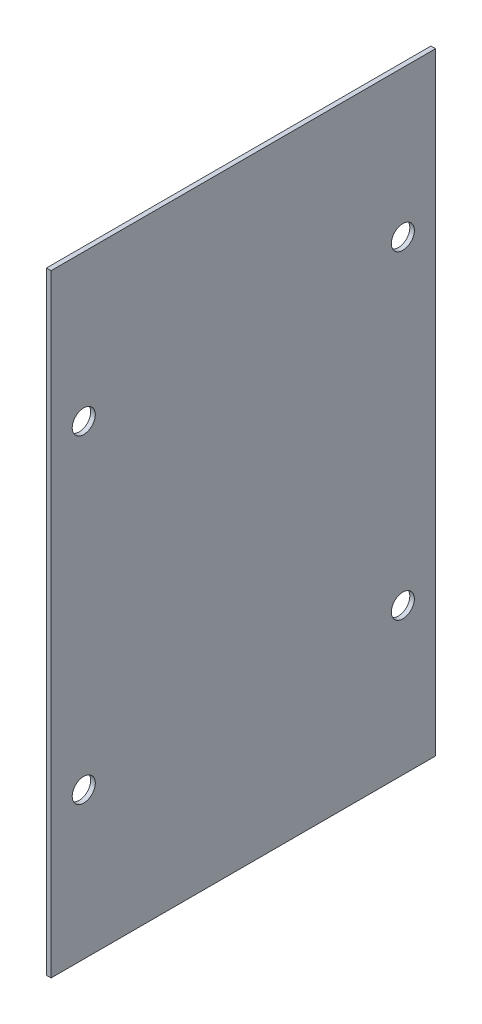
ISO-10303-21;
HEADER;
FILE_DESCRIPTION(('STEP AP214'),'2;1');
FILE_NAME('part.step','',(''),(''),'','','');
FILE_SCHEMA(('AUTOMOTIVE_DESIGN { 1 0 10303 214 1 1 1 1 }'));
ENDSEC;
DATA;
#1=APPLICATION_CONTEXT('core data for automotive mechanical design processes');
#2=APPLICATION_PROTOCOL_DEFINITION('international standard','automotive_design',2000,#1);
#3=PRODUCT_CONTEXT('',#1,'mechanical');
#4=PRODUCT('Part','Part','',(#3));
#5=PRODUCT_RELATED_PRODUCT_CATEGORY('part','',(#4));
#6=PRODUCT_DEFINITION_FORMATION('','',#4);
#7=PRODUCT_DEFINITION_CONTEXT('part definition',#1,'design');
#8=PRODUCT_DEFINITION('design','',#6,#7);
#9=PRODUCT_DEFINITION_SHAPE('','',#8);
#10=(LENGTH_UNIT() NAMED_UNIT(*) SI_UNIT(.MILLI.,.METRE.));
#11=(NAMED_UNIT(*) PLANE_ANGLE_UNIT() SI_UNIT($,.RADIAN.));
#12=(NAMED_UNIT(*) SI_UNIT($,.STERADIAN.) SOLID_ANGLE_UNIT());
#13=UNCERTAINTY_MEASURE_WITH_UNIT(LENGTH_MEASURE(1.E-05),#10,'distance_accuracy_value','');
#14=(GEOMETRIC_REPRESENTATION_CONTEXT(3) GLOBAL_UNCERTAINTY_ASSIGNED_CONTEXT((#13)) GLOBAL_UNIT_ASSIGNED_CONTEXT((#10,
#11,#12)) REPRESENTATION_CONTEXT('',''));
#15=CARTESIAN_POINT('',(0.,0.,0.));
#16=DIRECTION('',(0.,0.,1.));
#17=DIRECTION('',(1.,0.,0.));
#18=AXIS2_PLACEMENT_3D('',#15,#16,#17);
#19=CARTESIAN_POINT('',(-50.,47.,-49.9999999999997));
#20=DIRECTION('',(0.,0.,-1.));
#21=DIRECTION('',(0.,-1.,0.));
#22=AXIS2_PLACEMENT_3D('',#19,#20,#21);
#23=PLANE('',#22);
#24=DIRECTION('',(1.,0.,0.));
#25=VECTOR('',#24,1.);
#26=CARTESIAN_POINT('',(-50.,47.,-49.9999999999997));
#27=LINE('',#26,#25);
#28=CARTESIAN_POINT('',(-51.2,47.,-50.));
#29=VERTEX_POINT('',#28);
#30=CARTESIAN_POINT('',(-50.,47.,-49.9999999999997));
#31=VERTEX_POINT('',#30);
#32=EDGE_CURVE('E11',#29,#31,#27,.T.);
#33=ORIENTED_EDGE('',*,*,#32,.F.);
#34=DIRECTION('',(0.,1.,0.));
#35=VECTOR('',#34,1.);
#36=CARTESIAN_POINT('',(-51.1999999999999,0.,-50.0000000000001));
#37=LINE('',#36,#35);
#38=CARTESIAN_POINT('',(-51.1999999999998,206.324640740579,-50.));
#39=VERTEX_POINT('',#38);
#40=EDGE_CURVE('E98',#39,#29,#37,.F.);
#41=ORIENTED_EDGE('',*,*,#40,.F.);
#42=DIRECTION('',(1.,0.,0.));
#43=VECTOR('',#42,1.);
#44=CARTESIAN_POINT('',(-49.9999999999998,206.324640740579,-49.9999999999997));
#45=LINE('',#44,#43);
#46=CARTESIAN_POINT('',(-49.9999999999998,206.324640740579,-49.9999999999997));
#47=VERTEX_POINT('',#46);
#48=EDGE_CURVE('E53',#39,#47,#45,.T.);
#49=ORIENTED_EDGE('',*,*,#48,.T.);
#50=DIRECTION('',(0.,-1.,0.));
#51=VECTOR('',#50,1.);
#52=CARTESIAN_POINT('',(-50.,47.,-49.9999999999997));
#53=LINE('',#52,#51);
#54=EDGE_CURVE('E124',#47,#31,#53,.T.);
#55=ORIENTED_EDGE('',*,*,#54,.T.);
#56=EDGE_LOOP('',(#33,#41,#49,#55));
#57=FACE_BOUND('',#56,.T.);
#58=ADVANCED_FACE('F42',(#57),#23,.T.);
#59=CARTESIAN_POINT('',(-49.9999999999998,206.324640740579,-49.9999999999997));
#60=DIRECTION('',(0.,1.,0.));
#61=DIRECTION('',(0.,0.,-1.));
#62=AXIS2_PLACEMENT_3D('',#59,#60,#61);
#63=PLANE('',#62);
#64=ORIENTED_EDGE('',*,*,#48,.F.);
#65=DIRECTION('',(0.,0.,1.));
#66=VECTOR('',#65,1.);
#67=CARTESIAN_POINT('',(-51.1999999999999,206.324640740579,0.));
#68=LINE('',#67,#66);
#69=CARTESIAN_POINT('',(-51.2,206.324640740579,50.));
#70=VERTEX_POINT('',#69);
#71=EDGE_CURVE('E112',#70,#39,#68,.F.);
#72=ORIENTED_EDGE('',*,*,#71,.F.);
#73=DIRECTION('',(1.,0.,0.));
#74=VECTOR('',#73,1.);
#75=CARTESIAN_POINT('',(-50.,206.324640740579,50.));
#76=LINE('',#75,#74);
#77=CARTESIAN_POINT('',(-50.,206.324640740579,50.));
#78=VERTEX_POINT('',#77);
#79=EDGE_CURVE('E61',#70,#78,#76,.T.);
#80=ORIENTED_EDGE('',*,*,#79,.T.);
#81=DIRECTION('',(0.,0.,-1.));
#82=VECTOR('',#81,1.);
#83=CARTESIAN_POINT('',(-49.9999999999998,206.324640740579,-49.9999999999997));
#84=LINE('',#83,#82);
#85=EDGE_CURVE('E92',#78,#47,#84,.T.);
#86=ORIENTED_EDGE('',*,*,#85,.T.);
#87=EDGE_LOOP('',(#64,#72,#80,#86));
#88=FACE_BOUND('',#87,.T.);
#89=ADVANCED_FACE('F129',(#88),#63,.T.);
#90=CARTESIAN_POINT('',(-50.,206.324640740579,50.));
#91=DIRECTION('',(0.,0.,1.));
#92=DIRECTION('',(0.,1.,0.));
#93=AXIS2_PLACEMENT_3D('',#90,#91,#92);
#94=PLANE('',#93);
#95=ORIENTED_EDGE('',*,*,#79,.F.);
#96=DIRECTION('',(0.,1.,0.));
#97=VECTOR('',#96,1.);
#98=CARTESIAN_POINT('',(-51.2000000000001,0.,50.));
#99=LINE('',#98,#97);
#100=CARTESIAN_POINT('',(-51.2,46.9999999999999,50.));
#101=VERTEX_POINT('',#100);
#102=EDGE_CURVE('E97',#101,#70,#99,.T.);
#103=ORIENTED_EDGE('',*,*,#102,.F.);
#104=DIRECTION('',(1.,0.,0.));
#105=VECTOR('',#104,1.);
#106=CARTESIAN_POINT('',(-50.0000000000001,46.9999999999999,50.));
#107=LINE('',#106,#105);
#108=CARTESIAN_POINT('',(-50.0000000000001,46.9999999999999,50.));
#109=VERTEX_POINT('',#108);
#110=EDGE_CURVE('E46',#101,#109,#107,.T.);
#111=ORIENTED_EDGE('',*,*,#110,.T.);
#112=DIRECTION('',(0.,1.,0.));
#113=VECTOR('',#112,1.);
#114=CARTESIAN_POINT('',(-50.,206.324640740579,50.));
#115=LINE('',#114,#113);
#116=EDGE_CURVE('E205',#109,#78,#115,.T.);
#117=ORIENTED_EDGE('',*,*,#116,.T.);
#118=EDGE_LOOP('',(#95,#103,#111,#117));
#119=FACE_BOUND('',#118,.T.);
#120=ADVANCED_FACE('F101',(#119),#94,.T.);
#121=CARTESIAN_POINT('',(-49.9999999999999,168.16232037029,-41.4999999999997));
#122=DIRECTION('',(-1.,0.,0.));
#123=DIRECTION('',(0.,0.,1.));
#124=AXIS2_PLACEMENT_3D('',#121,#122,#123);
#125=CYLINDRICAL_SURFACE('',#124,3.);
#126=CARTESIAN_POINT('',(-49.9999999999999,168.16232037029,-41.4999999999997));
#127=DIRECTION('',(-1.,0.,0.));
#128=DIRECTION('',(0.,0.,1.));
#129=AXIS2_PLACEMENT_3D('',#126,#127,#128);
#130=CIRCLE('',#129,3.);
#131=CARTESIAN_POINT('',(-49.9999999999999,168.16232037029,-38.4999999999997));
#132=VERTEX_POINT('',#131);
#133=EDGE_CURVE('E115',#132,#132,#130,.T.);
#134=ORIENTED_EDGE('',*,*,#133,.F.);
#135=EDGE_LOOP('',(#134));
#136=FACE_BOUND('',#135,.T.);
#137=CARTESIAN_POINT('',(-51.1999999999999,168.16232037029,-41.5));
#138=DIRECTION('',(-1.,0.,0.));
#139=DIRECTION('',(0.,0.,1.));
#140=AXIS2_PLACEMENT_3D('',#137,#138,#139);
#141=CIRCLE('',#140,3.);
#142=CARTESIAN_POINT('',(-51.1999999999999,168.16232037029,-38.5));
#143=VERTEX_POINT('',#142);
#144=EDGE_CURVE('E136',#143,#143,#141,.T.);
#145=ORIENTED_EDGE('',*,*,#144,.T.);
#146=EDGE_LOOP('',(#145));
#147=FACE_BOUND('',#146,.T.);
#148=ADVANCED_FACE('F175',(#136,#147),#125,.F.);
#149=CARTESIAN_POINT('',(-50.,168.16232037029,41.4999999999999));
#150=DIRECTION('',(-1.,0.,0.));
#151=DIRECTION('',(0.,0.,1.));
#152=AXIS2_PLACEMENT_3D('',#149,#150,#151);
#153=CYLINDRICAL_SURFACE('',#152,3.);
#154=CARTESIAN_POINT('',(-50.,168.16232037029,41.4999999999999));
#155=DIRECTION('',(-1.,0.,0.));
#156=DIRECTION('',(0.,0.,1.));
#157=AXIS2_PLACEMENT_3D('',#154,#155,#156);
#158=CIRCLE('',#157,3.);
#159=CARTESIAN_POINT('',(-50.,168.16232037029,44.4999999999999));
#160=VERTEX_POINT('',#159);
#161=EDGE_CURVE('E198',#160,#160,#158,.T.);
#162=ORIENTED_EDGE('',*,*,#161,.F.);
#163=EDGE_LOOP('',(#162));
#164=FACE_BOUND('',#163,.T.);
#165=CARTESIAN_POINT('',(-51.2,168.16232037029,41.5));
#166=DIRECTION('',(-1.,0.,0.));
#167=DIRECTION('',(0.,0.,1.));
#168=AXIS2_PLACEMENT_3D('',#165,#166,#167);
#169=CIRCLE('',#168,3.);
#170=CARTESIAN_POINT('',(-51.2,168.16232037029,44.5));
#171=VERTEX_POINT('',#170);
#172=EDGE_CURVE('E139',#171,#171,#169,.T.);
#173=ORIENTED_EDGE('',*,*,#172,.T.);
#174=EDGE_LOOP('',(#173));
#175=FACE_BOUND('',#174,.T.);
#176=ADVANCED_FACE('F164',(#164,#175),#153,.F.);
#177=CARTESIAN_POINT('',(-50.,85.1623203702897,41.5));
#178=DIRECTION('',(-1.,0.,0.));
#179=DIRECTION('',(0.,0.,1.));
#180=AXIS2_PLACEMENT_3D('',#177,#178,#179);
#181=CYLINDRICAL_SURFACE('',#180,3.);
#182=CARTESIAN_POINT('',(-50.,85.1623203702897,41.5));
#183=DIRECTION('',(-1.,0.,0.));
#184=DIRECTION('',(0.,0.,1.));
#185=AXIS2_PLACEMENT_3D('',#182,#183,#184);
#186=CIRCLE('',#185,3.);
#187=CARTESIAN_POINT('',(-50.,85.1623203702897,44.5));
#188=VERTEX_POINT('',#187);
#189=EDGE_CURVE('E202',#188,#188,#186,.T.);
#190=ORIENTED_EDGE('',*,*,#189,.F.);
#191=EDGE_LOOP('',(#190));
#192=FACE_BOUND('',#191,.T.);
#193=CARTESIAN_POINT('',(-51.2,85.1623203702897,41.5));
#194=DIRECTION('',(-1.,0.,0.));
#195=DIRECTION('',(0.,0.,1.));
#196=AXIS2_PLACEMENT_3D('',#193,#194,#195);
#197=CIRCLE('',#196,3.);
#198=CARTESIAN_POINT('',(-51.2,85.1623203702897,44.5));
#199=VERTEX_POINT('',#198);
#200=EDGE_CURVE('E108',#199,#199,#197,.T.);
#201=ORIENTED_EDGE('',*,*,#200,.T.);
#202=EDGE_LOOP('',(#201));
#203=FACE_BOUND('',#202,.T.);
#204=ADVANCED_FACE('F148',(#192,#203),#181,.F.);
#205=CARTESIAN_POINT('',(-50.,85.1623203702897,-41.5));
#206=DIRECTION('',(-1.,0.,0.));
#207=DIRECTION('',(0.,0.,1.));
#208=AXIS2_PLACEMENT_3D('',#205,#206,#207);
#209=CYLINDRICAL_SURFACE('',#208,3.);
#210=CARTESIAN_POINT('',(-50.,85.1623203702897,-41.5));
#211=DIRECTION('',(-1.,0.,0.));
#212=DIRECTION('',(0.,0.,1.));
#213=AXIS2_PLACEMENT_3D('',#210,#211,#212);
#214=CIRCLE('',#213,3.);
#215=CARTESIAN_POINT('',(-50.,85.1623203702897,-38.5));
#216=VERTEX_POINT('',#215);
#217=EDGE_CURVE('E204',#216,#216,#214,.T.);
#218=ORIENTED_EDGE('',*,*,#217,.F.);
#219=EDGE_LOOP('',(#218));
#220=FACE_BOUND('',#219,.T.);
#221=CARTESIAN_POINT('',(-51.2000000000001,85.1623203702897,-41.5000000000001));
#222=DIRECTION('',(-1.,0.,0.));
#223=DIRECTION('',(0.,0.,1.));
#224=AXIS2_PLACEMENT_3D('',#221,#222,#223);
#225=CIRCLE('',#224,3.);
#226=CARTESIAN_POINT('',(-51.2000000000001,85.1623203702897,-38.5000000000001));
#227=VERTEX_POINT('',#226);
#228=EDGE_CURVE('E103',#227,#227,#225,.T.);
#229=ORIENTED_EDGE('',*,*,#228,.T.);
#230=EDGE_LOOP('',(#229));
#231=FACE_BOUND('',#230,.T.);
#232=ADVANCED_FACE('F156',(#220,#231),#209,.F.);
#233=CARTESIAN_POINT('',(-50.,47.,-49.9999999999997));
#234=DIRECTION('',(0.,-1.,0.));
#235=DIRECTION('',(0.,0.,1.));
#236=AXIS2_PLACEMENT_3D('',#233,#234,#235);
#237=PLANE('',#236);
#238=DIRECTION('',(0.,0.,1.));
#239=VECTOR('',#238,1.);
#240=CARTESIAN_POINT('',(-51.2000000000001,47.,0.));
#241=LINE('',#240,#239);
#242=EDGE_CURVE('E85',#29,#101,#241,.T.);
#243=ORIENTED_EDGE('',*,*,#242,.F.);
#244=ORIENTED_EDGE('',*,*,#32,.T.);
#245=DIRECTION('',(0.,0.,1.));
#246=VECTOR('',#245,1.);
#247=CARTESIAN_POINT('',(-50.,47.,-49.9999999999997));
#248=LINE('',#247,#246);
#249=EDGE_CURVE('E87',#31,#109,#248,.T.);
#250=ORIENTED_EDGE('',*,*,#249,.T.);
#251=ORIENTED_EDGE('',*,*,#110,.F.);
#252=EDGE_LOOP('',(#243,#244,#250,#251));
#253=FACE_BOUND('',#252,.T.);
#254=ADVANCED_FACE('F44',(#253),#237,.T.);
#255=CARTESIAN_POINT('',(-50.,0.,0.));
#256=DIRECTION('',(-1.,0.,0.));
#257=DIRECTION('',(0.,0.,1.));
#258=AXIS2_PLACEMENT_3D('',#255,#256,#257);
#259=PLANE('',#258);
#260=ORIENTED_EDGE('',*,*,#133,.T.);
#261=EDGE_LOOP('',(#260));
#262=FACE_BOUND('',#261,.T.);
#263=ORIENTED_EDGE('',*,*,#161,.T.);
#264=EDGE_LOOP('',(#263));
#265=FACE_BOUND('',#264,.T.);
#266=ORIENTED_EDGE('',*,*,#189,.T.);
#267=EDGE_LOOP('',(#266));
#268=FACE_BOUND('',#267,.T.);
#269=ORIENTED_EDGE('',*,*,#217,.T.);
#270=EDGE_LOOP('',(#269));
#271=FACE_BOUND('',#270,.T.);
#272=ORIENTED_EDGE('',*,*,#116,.F.);
#273=ORIENTED_EDGE('',*,*,#249,.F.);
#274=ORIENTED_EDGE('',*,*,#54,.F.);
#275=ORIENTED_EDGE('',*,*,#85,.F.);
#276=EDGE_LOOP('',(#272,#273,#274,#275));
#277=FACE_BOUND('',#276,.T.);
#278=ADVANCED_FACE('F127',(#262,#265,#268,#271,#277),#259,.F.);
#279=CARTESIAN_POINT('',(-51.2,0.,0.));
#280=DIRECTION('',(-1.,0.,0.));
#281=DIRECTION('',(0.,0.,1.));
#282=AXIS2_PLACEMENT_3D('',#279,#280,#281);
#283=PLANE('',#282);
#284=ORIENTED_EDGE('',*,*,#144,.F.);
#285=EDGE_LOOP('',(#284));
#286=FACE_BOUND('',#285,.T.);
#287=ORIENTED_EDGE('',*,*,#172,.F.);
#288=EDGE_LOOP('',(#287));
#289=FACE_BOUND('',#288,.T.);
#290=ORIENTED_EDGE('',*,*,#200,.F.);
#291=EDGE_LOOP('',(#290));
#292=FACE_BOUND('',#291,.T.);
#293=ORIENTED_EDGE('',*,*,#228,.F.);
#294=EDGE_LOOP('',(#293));
#295=FACE_BOUND('',#294,.T.);
#296=ORIENTED_EDGE('',*,*,#102,.T.);
#297=ORIENTED_EDGE('',*,*,#71,.T.);
#298=ORIENTED_EDGE('',*,*,#40,.T.);
#299=ORIENTED_EDGE('',*,*,#242,.T.);
#300=EDGE_LOOP('',(#296,#297,#298,#299));
#301=FACE_BOUND('',#300,.T.);
#302=ADVANCED_FACE('F95',(#286,#289,#292,#295,#301),#283,.T.);
#303=CLOSED_SHELL('',(#58,#89,#120,#148,#176,#204,#232,#254,#278,#302));
#304=MANIFOLD_SOLID_BREP('B2',#303);
#305=ADVANCED_BREP_SHAPE_REPRESENTATION('',(#18,#304),#14);
#306=SHAPE_DEFINITION_REPRESENTATION(#9,#305);
ENDSEC;
END-ISO-10303-21;
